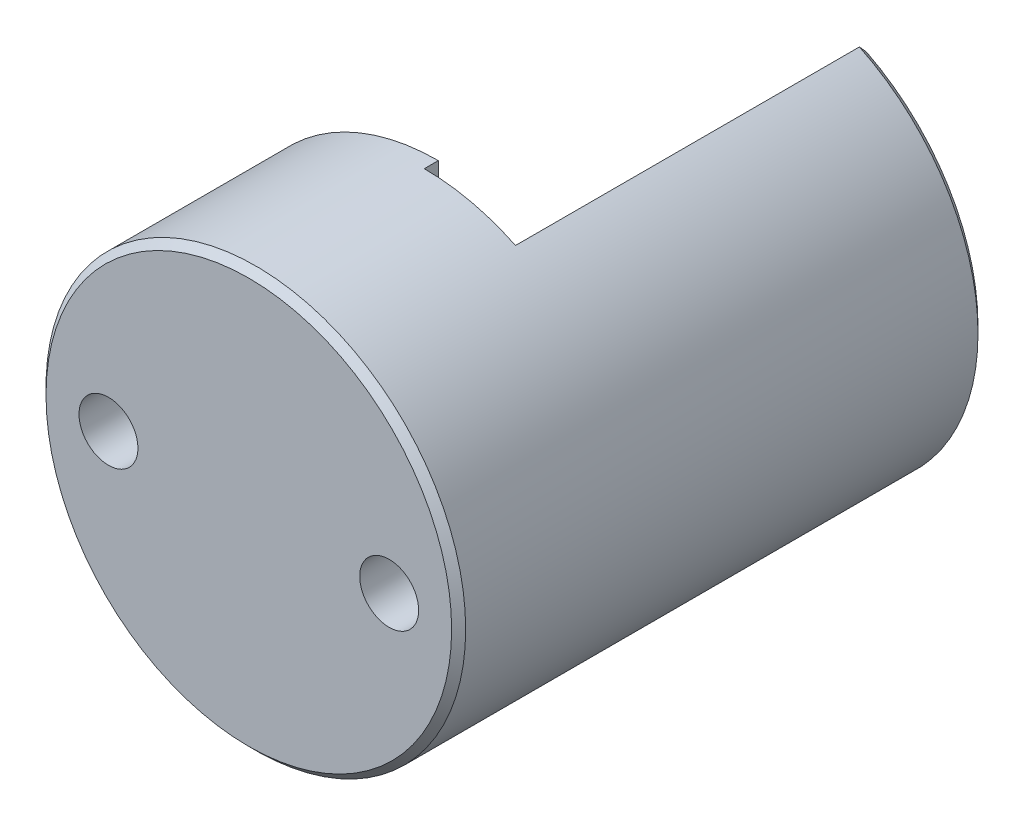
ISO-10303-21;
HEADER;
FILE_DESCRIPTION(('STEP AP214'),'2;1');
FILE_NAME('part.step','',(''),(''),'','','');
FILE_SCHEMA(('AUTOMOTIVE_DESIGN { 1 0 10303 214 1 1 1 1 }'));
ENDSEC;
DATA;
#1=APPLICATION_CONTEXT('core data for automotive mechanical design processes');
#2=APPLICATION_PROTOCOL_DEFINITION('international standard','automotive_design',2000,#1);
#3=PRODUCT_CONTEXT('',#1,'mechanical');
#4=PRODUCT('Part','Part','',(#3));
#5=PRODUCT_RELATED_PRODUCT_CATEGORY('part','',(#4));
#6=PRODUCT_DEFINITION_FORMATION('','',#4);
#7=PRODUCT_DEFINITION_CONTEXT('part definition',#1,'design');
#8=PRODUCT_DEFINITION('design','',#6,#7);
#9=PRODUCT_DEFINITION_SHAPE('','',#8);
#10=(LENGTH_UNIT() NAMED_UNIT(*) SI_UNIT(.MILLI.,.METRE.));
#11=(NAMED_UNIT(*) PLANE_ANGLE_UNIT() SI_UNIT($,.RADIAN.));
#12=(NAMED_UNIT(*) SI_UNIT($,.STERADIAN.) SOLID_ANGLE_UNIT());
#13=UNCERTAINTY_MEASURE_WITH_UNIT(LENGTH_MEASURE(1.E-05),#10,'distance_accuracy_value','');
#14=(GEOMETRIC_REPRESENTATION_CONTEXT(3) GLOBAL_UNCERTAINTY_ASSIGNED_CONTEXT((#13)) GLOBAL_UNIT_ASSIGNED_CONTEXT((#10,
#11,#12)) REPRESENTATION_CONTEXT('',''));
#15=CARTESIAN_POINT('',(0.,0.,0.));
#16=DIRECTION('',(0.,0.,1.));
#17=DIRECTION('',(1.,0.,0.));
#18=AXIS2_PLACEMENT_3D('',#15,#16,#17);
#19=CARTESIAN_POINT('',(0.,0.,-12.5));
#20=DIRECTION('',(0.,0.,-1.));
#21=DIRECTION('',(-1.,0.,0.));
#22=AXIS2_PLACEMENT_3D('',#19,#20,#21);
#23=PLANE('',#22);
#24=CARTESIAN_POINT('',(0.,0.,-12.5));
#25=DIRECTION('',(0.,0.,-1.));
#26=DIRECTION('',(-1.,0.,0.));
#27=AXIS2_PLACEMENT_3D('',#24,#25,#26);
#28=CIRCLE('',#27,14.9495727735252);
#29=CARTESIAN_POINT('',(6.66499415117538E-10,14.9495727735252,-12.5));
#30=VERTEX_POINT('',#29);
#31=CARTESIAN_POINT('',(6.49981606336589,13.4626192567916,-12.5));
#32=VERTEX_POINT('',#31);
#33=EDGE_CURVE('E98',#30,#32,#28,.T.);
#34=ORIENTED_EDGE('',*,*,#33,.T.);
#35=DIRECTION('',(0.,1.,0.));
#36=VECTOR('',#35,1.);
#37=CARTESIAN_POINT('',(6.49981606336589,13.4626192567916,-12.5));
#38=LINE('',#37,#36);
#39=CARTESIAN_POINT('',(6.49981606336589,-13.4626192567917,-12.5));
#40=VERTEX_POINT('',#39);
#41=EDGE_CURVE('E105',#40,#32,#38,.T.);
#42=ORIENTED_EDGE('',*,*,#41,.F.);
#43=CARTESIAN_POINT('',(6.66499415117538E-10,-14.9495727735252,-12.5));
#44=VERTEX_POINT('',#43);
#45=EDGE_CURVE('E114',#40,#44,#28,.T.);
#46=ORIENTED_EDGE('',*,*,#45,.T.);
#47=DIRECTION('',(0.,-1.,0.));
#48=VECTOR('',#47,1.);
#49=CARTESIAN_POINT('',(6.66499415117538E-10,14.9495727735252,-12.5));
#50=LINE('',#49,#48);
#51=EDGE_CURVE('E112',#30,#44,#50,.T.);
#52=ORIENTED_EDGE('',*,*,#51,.F.);
#53=EDGE_LOOP('',(#34,#42,#46,#52));
#54=FACE_BOUND('',#53,.T.);
#55=ADVANCED_FACE('F47',(#54),#23,.T.);
#56=CARTESIAN_POINT('',(0.,0.,-7.5));
#57=DIRECTION('',(0.,0.,1.));
#58=DIRECTION('',(1.,0.,0.));
#59=AXIS2_PLACEMENT_3D('',#56,#57,#58);
#60=CYLINDRICAL_SURFACE('',#59,14.9495727735252);
#61=CARTESIAN_POINT('',(0.,0.,-0.499999999999999));
#62=DIRECTION('',(0.,0.,1.));
#63=DIRECTION('',(1.,0.,0.));
#64=AXIS2_PLACEMENT_3D('',#61,#62,#63);
#65=CIRCLE('',#64,14.9495727735252);
#66=CARTESIAN_POINT('',(14.9495727735252,0.,-0.499999999999999));
#67=VERTEX_POINT('',#66);
#68=EDGE_CURVE('E11',#67,#67,#65,.F.);
#69=ORIENTED_EDGE('',*,*,#68,.T.);
#70=EDGE_LOOP('',(#69));
#71=FACE_BOUND('',#70,.T.);
#72=DIRECTION('',(0.,0.,1.));
#73=VECTOR('',#72,1.);
#74=CARTESIAN_POINT('',(6.49981606336589,-13.4626192567917,-37.5));
#75=LINE('',#74,#73);
#76=CARTESIAN_POINT('',(6.49981606336589,-13.4626192567917,-37.));
#77=VERTEX_POINT('',#76);
#78=EDGE_CURVE('E101',#77,#40,#75,.T.);
#79=ORIENTED_EDGE('',*,*,#78,.F.);
#80=CARTESIAN_POINT('',(0.,0.,-37.));
#81=DIRECTION('',(0.,0.,-1.));
#82=DIRECTION('',(-1.,0.,0.));
#83=AXIS2_PLACEMENT_3D('',#80,#81,#82);
#84=CIRCLE('',#83,14.9495727735252);
#85=CARTESIAN_POINT('',(6.49981606336589,13.4626192567916,-37.));
#86=VERTEX_POINT('',#85);
#87=EDGE_CURVE('E70',#77,#86,#84,.F.);
#88=ORIENTED_EDGE('',*,*,#87,.T.);
#89=DIRECTION('',(0.,0.,1.));
#90=VECTOR('',#89,1.);
#91=CARTESIAN_POINT('',(6.49981606336589,13.4626192567916,-37.5));
#92=LINE('',#91,#90);
#93=EDGE_CURVE('E93',#86,#32,#92,.T.);
#94=ORIENTED_EDGE('',*,*,#93,.T.);
#95=ORIENTED_EDGE('',*,*,#33,.F.);
#96=DIRECTION('',(0.,0.,1.));
#97=VECTOR('',#96,1.);
#98=CARTESIAN_POINT('',(6.66499415117538E-10,14.9495727735252,-13.5));
#99=LINE('',#98,#97);
#100=CARTESIAN_POINT('',(6.66499415117538E-10,14.9495727735252,-13.5));
#101=VERTEX_POINT('',#100);
#102=EDGE_CURVE('E119',#101,#30,#99,.T.);
#103=ORIENTED_EDGE('',*,*,#102,.F.);
#104=CARTESIAN_POINT('',(0.,0.,-13.5));
#105=DIRECTION('',(0.,0.,-1.));
#106=DIRECTION('',(-1.,0.,0.));
#107=AXIS2_PLACEMENT_3D('',#104,#105,#106);
#108=CIRCLE('',#107,14.9495727735252);
#109=CARTESIAN_POINT('',(6.66499415117538E-10,-14.9495727735252,-13.5));
#110=VERTEX_POINT('',#109);
#111=EDGE_CURVE('E222',#110,#101,#108,.T.);
#112=ORIENTED_EDGE('',*,*,#111,.F.);
#113=DIRECTION('',(0.,0.,1.));
#114=VECTOR('',#113,1.);
#115=CARTESIAN_POINT('',(6.66499415117538E-10,-14.9495727735252,-13.5));
#116=LINE('',#115,#114);
#117=EDGE_CURVE('E227',#110,#44,#116,.T.);
#118=ORIENTED_EDGE('',*,*,#117,.T.);
#119=ORIENTED_EDGE('',*,*,#45,.F.);
#120=EDGE_LOOP('',(#79,#88,#94,#95,#103,#112,#118,#119));
#121=FACE_BOUND('',#120,.T.);
#122=ADVANCED_FACE('F95',(#71,#121),#60,.T.);
#123=CARTESIAN_POINT('',(0.,0.,0.));
#124=DIRECTION('',(0.,0.,1.));
#125=DIRECTION('',(1.,0.,0.));
#126=AXIS2_PLACEMENT_3D('',#123,#124,#125);
#127=PLANE('',#126);
#128=CARTESIAN_POINT('',(0.,0.,0.));
#129=DIRECTION('',(0.,0.,1.));
#130=DIRECTION('',(1.,0.,0.));
#131=AXIS2_PLACEMENT_3D('',#128,#129,#130);
#132=CIRCLE('',#131,14.4495727735252);
#133=CARTESIAN_POINT('',(14.4495727735252,0.,0.));
#134=VERTEX_POINT('',#133);
#135=EDGE_CURVE('E56',#134,#134,#132,.T.);
#136=ORIENTED_EDGE('',*,*,#135,.T.);
#137=EDGE_LOOP('',(#136));
#138=FACE_BOUND('',#137,.T.);
#139=CARTESIAN_POINT('',(-9.99999977648258,9.6393704650255E-10,0.));
#140=DIRECTION('',(0.,0.,1.));
#141=DIRECTION('',(1.,0.,0.));
#142=AXIS2_PLACEMENT_3D('',#139,#140,#141);
#143=CIRCLE('',#142,2.09990390331337);
#144=CARTESIAN_POINT('',(-7.90009587316921,9.6393704650255E-10,0.));
#145=VERTEX_POINT('',#144);
#146=EDGE_CURVE('E113',#145,#145,#143,.T.);
#147=ORIENTED_EDGE('',*,*,#146,.F.);
#148=EDGE_LOOP('',(#147));
#149=FACE_BOUND('',#148,.T.);
#150=CARTESIAN_POINT('',(9.99999977648258,-9.62342185106824E-10,0.));
#151=DIRECTION('',(0.,0.,1.));
#152=DIRECTION('',(1.,0.,0.));
#153=AXIS2_PLACEMENT_3D('',#150,#151,#152);
#154=CIRCLE('',#153,2.09990390331337);
#155=CARTESIAN_POINT('',(12.099903679796,-9.62342185106824E-10,0.));
#156=VERTEX_POINT('',#155);
#157=EDGE_CURVE('E124',#156,#156,#154,.T.);
#158=ORIENTED_EDGE('',*,*,#157,.F.);
#159=EDGE_LOOP('',(#158));
#160=FACE_BOUND('',#159,.T.);
#161=ADVANCED_FACE('F179',(#138,#149,#160),#127,.T.);
#162=CARTESIAN_POINT('',(9.99999977648258,-9.62342185106824E-10,-7.5));
#163=DIRECTION('',(0.,0.,1.));
#164=DIRECTION('',(1.,0.,0.));
#165=AXIS2_PLACEMENT_3D('',#162,#163,#164);
#166=CYLINDRICAL_SURFACE('',#165,2.09990390331337);
#167=CARTESIAN_POINT('',(9.99999977648258,-9.62342185106824E-10,-7.5));
#168=DIRECTION('',(0.,0.,1.));
#169=DIRECTION('',(1.,0.,0.));
#170=AXIS2_PLACEMENT_3D('',#167,#168,#169);
#171=CIRCLE('',#170,2.09990390331337);
#172=CARTESIAN_POINT('',(12.099903679796,-9.62342185106824E-10,-7.5));
#173=VERTEX_POINT('',#172);
#174=EDGE_CURVE('E126',#173,#173,#171,.T.);
#175=ORIENTED_EDGE('',*,*,#174,.F.);
#176=EDGE_LOOP('',(#175));
#177=FACE_BOUND('',#176,.T.);
#178=ORIENTED_EDGE('',*,*,#157,.T.);
#179=EDGE_LOOP('',(#178));
#180=FACE_BOUND('',#179,.T.);
#181=ADVANCED_FACE('F175',(#177,#180),#166,.F.);
#182=CARTESIAN_POINT('',(-9.99999977648258,9.6393704650255E-10,-7.5));
#183=DIRECTION('',(0.,0.,1.));
#184=DIRECTION('',(1.,0.,0.));
#185=AXIS2_PLACEMENT_3D('',#182,#183,#184);
#186=CYLINDRICAL_SURFACE('',#185,2.09990390331337);
#187=CARTESIAN_POINT('',(-9.99999977648258,9.6393704650255E-10,-7.5));
#188=DIRECTION('',(0.,0.,1.));
#189=DIRECTION('',(1.,0.,0.));
#190=AXIS2_PLACEMENT_3D('',#187,#188,#189);
#191=CIRCLE('',#190,2.09990390331337);
#192=CARTESIAN_POINT('',(-7.90009587316921,9.6393704650255E-10,-7.5));
#193=VERTEX_POINT('',#192);
#194=EDGE_CURVE('E117',#193,#193,#191,.T.);
#195=ORIENTED_EDGE('',*,*,#194,.F.);
#196=EDGE_LOOP('',(#195));
#197=FACE_BOUND('',#196,.T.);
#198=ORIENTED_EDGE('',*,*,#146,.T.);
#199=EDGE_LOOP('',(#198));
#200=FACE_BOUND('',#199,.T.);
#201=ADVANCED_FACE('F172',(#197,#200),#186,.F.);
#202=CARTESIAN_POINT('',(0.,0.,-7.5));
#203=DIRECTION('',(0.,0.,-1.));
#204=DIRECTION('',(-1.,0.,0.));
#205=AXIS2_PLACEMENT_3D('',#202,#203,#204);
#206=PLANE('',#205);
#207=ORIENTED_EDGE('',*,*,#174,.T.);
#208=EDGE_LOOP('',(#207));
#209=FACE_BOUND('',#208,.T.);
#210=ADVANCED_FACE('F170',(#209),#206,.F.);
#211=ORIENTED_EDGE('',*,*,#194,.T.);
#212=EDGE_LOOP('',(#211));
#213=FACE_BOUND('',#212,.T.);
#214=ADVANCED_FACE('F164',(#213),#206,.F.);
#215=CARTESIAN_POINT('',(6.66499415117538E-10,14.9495727735252,-13.5));
#216=DIRECTION('',(-1.,0.,0.));
#217=DIRECTION('',(0.,0.,1.));
#218=AXIS2_PLACEMENT_3D('',#215,#216,#217);
#219=PLANE('',#218);
#220=ORIENTED_EDGE('',*,*,#51,.T.);
#221=ORIENTED_EDGE('',*,*,#117,.F.);
#222=DIRECTION('',(0.,-1.,0.));
#223=VECTOR('',#222,1.);
#224=CARTESIAN_POINT('',(6.66499415117538E-10,14.9495727735252,-13.5));
#225=LINE('',#224,#223);
#226=EDGE_CURVE('E225',#101,#110,#225,.T.);
#227=ORIENTED_EDGE('',*,*,#226,.F.);
#228=ORIENTED_EDGE('',*,*,#102,.T.);
#229=EDGE_LOOP('',(#220,#221,#227,#228));
#230=FACE_BOUND('',#229,.T.);
#231=ADVANCED_FACE('F160',(#230),#219,.F.);
#232=CARTESIAN_POINT('',(0.,0.,-13.5));
#233=DIRECTION('',(0.,0.,-1.));
#234=DIRECTION('',(-1.,0.,0.));
#235=AXIS2_PLACEMENT_3D('',#232,#233,#234);
#236=PLANE('',#235);
#237=ORIENTED_EDGE('',*,*,#111,.T.);
#238=ORIENTED_EDGE('',*,*,#226,.T.);
#239=EDGE_LOOP('',(#237,#238));
#240=FACE_BOUND('',#239,.T.);
#241=ADVANCED_FACE('F155',(#240),#236,.T.);
#242=CARTESIAN_POINT('',(6.49981606336589,13.4626192567916,-37.5));
#243=DIRECTION('',(1.,0.,0.));
#244=DIRECTION('',(0.,1.,0.));
#245=AXIS2_PLACEMENT_3D('',#242,#243,#244);
#246=PLANE('',#245);
#247=DIRECTION('',(0.,1.,0.));
#248=VECTOR('',#247,1.);
#249=CARTESIAN_POINT('',(6.49981606336589,13.4626192567916,-37.5));
#250=LINE('',#249,#248);
#251=CARTESIAN_POINT('',(6.49981606336589,-12.9051363603726,-37.5));
#252=VERTEX_POINT('',#251);
#253=CARTESIAN_POINT('',(6.49981606336589,12.9051363603726,-37.5));
#254=VERTEX_POINT('',#253);
#255=EDGE_CURVE('E102',#252,#254,#250,.T.);
#256=ORIENTED_EDGE('',*,*,#255,.F.);
#257=CARTESIAN_POINT('',(6.49981606336589,-12.9051363603726,-37.5));
#258=CARTESIAN_POINT('',(6.49981606336589,-12.998221467456,-37.4168576469292));
#259=CARTESIAN_POINT('',(6.49981606336589,-13.0912209298656,-37.333619802977));
#260=CARTESIAN_POINT('',(6.49981606336589,-13.2770485619991,-37.1669531363034));
#261=CARTESIAN_POINT('',(6.49981606336589,-13.3698767317291,-37.0835243135891));
#262=CARTESIAN_POINT('',(6.49981606336589,-13.4626192567916,-37.));
#263=B_SPLINE_CURVE_WITH_KNOTS('',3,(#257,#258,#259,#260,#261,#262),.UNSPECIFIED.,.F.,.F.,(4,2,
4),(0.,0.374428829110022,0.748857644767244),.UNSPECIFIED.);
#264=EDGE_CURVE('E63',#252,#77,#263,.T.);
#265=ORIENTED_EDGE('',*,*,#264,.T.);
#266=ORIENTED_EDGE('',*,*,#78,.T.);
#267=ORIENTED_EDGE('',*,*,#41,.T.);
#268=ORIENTED_EDGE('',*,*,#93,.F.);
#269=CARTESIAN_POINT('',(6.49981606336589,13.4626192567917,-37.));
#270=CARTESIAN_POINT('',(6.49981606336589,13.3698767317291,-37.0835243135891));
#271=CARTESIAN_POINT('',(6.49981606336589,13.2770485619991,-37.1669531363034));
#272=CARTESIAN_POINT('',(6.49981606336589,13.0912209298656,-37.333619802977));
#273=CARTESIAN_POINT('',(6.49981606336589,12.998221467456,-37.4168576469292));
#274=CARTESIAN_POINT('',(6.49981606336589,12.9051363603726,-37.5));
#275=B_SPLINE_CURVE_WITH_KNOTS('',3,(#269,#270,#271,#272,#273,#274),.UNSPECIFIED.,.F.,.F.,(4,2,
4),(0.,0.374428815657224,0.748857644767247),.UNSPECIFIED.);
#276=EDGE_CURVE('E134',#86,#254,#275,.T.);
#277=ORIENTED_EDGE('',*,*,#276,.T.);
#278=EDGE_LOOP('',(#256,#265,#266,#267,#268,#277));
#279=FACE_BOUND('',#278,.T.);
#280=ADVANCED_FACE('F106',(#279),#246,.F.);
#281=CARTESIAN_POINT('',(0.,0.,-37.5));
#282=DIRECTION('',(0.,0.,-1.));
#283=DIRECTION('',(-1.,0.,0.));
#284=AXIS2_PLACEMENT_3D('',#281,#282,#283);
#285=PLANE('',#284);
#286=CARTESIAN_POINT('',(9.99999977648258,-9.66594642867746E-10,-37.5));
#287=DIRECTION('',(0.,0.,-1.));
#288=DIRECTION('',(-1.,0.,0.));
#289=AXIS2_PLACEMENT_3D('',#286,#287,#288);
#290=CIRCLE('',#289,2.09990390319453);
#291=CARTESIAN_POINT('',(7.90009587328806,-9.66594642867746E-10,-37.5));
#292=VERTEX_POINT('',#291);
#293=EDGE_CURVE('E218',#292,#292,#290,.T.);
#294=ORIENTED_EDGE('',*,*,#293,.F.);
#295=EDGE_LOOP('',(#294));
#296=FACE_BOUND('',#295,.T.);
#297=ORIENTED_EDGE('',*,*,#255,.T.);
#298=CARTESIAN_POINT('',(0.,0.,-37.5));
#299=DIRECTION('',(0.,0.,-1.));
#300=DIRECTION('',(-1.,0.,0.));
#301=AXIS2_PLACEMENT_3D('',#298,#299,#300);
#302=CIRCLE('',#301,14.4495727735252);
#303=EDGE_CURVE('E129',#254,#252,#302,.T.);
#304=ORIENTED_EDGE('',*,*,#303,.T.);
#305=EDGE_LOOP('',(#297,#304));
#306=FACE_BOUND('',#305,.T.);
#307=ADVANCED_FACE('F154',(#296,#306),#285,.T.);
#308=CARTESIAN_POINT('',(9.99999977648258,-9.66594642867746E-10,-30.5));
#309=DIRECTION('',(0.,0.,-1.));
#310=DIRECTION('',(-1.,0.,0.));
#311=AXIS2_PLACEMENT_3D('',#308,#309,#310);
#312=CYLINDRICAL_SURFACE('',#311,2.09990390319453);
#313=CARTESIAN_POINT('',(9.99999977648258,-9.66594642867746E-10,-30.5));
#314=DIRECTION('',(0.,0.,-1.));
#315=DIRECTION('',(-1.,0.,0.));
#316=AXIS2_PLACEMENT_3D('',#313,#314,#315);
#317=CIRCLE('',#316,2.09990390319453);
#318=CARTESIAN_POINT('',(7.90009587328806,-9.66594642867746E-10,-30.5));
#319=VERTEX_POINT('',#318);
#320=EDGE_CURVE('E109',#319,#319,#317,.T.);
#321=ORIENTED_EDGE('',*,*,#320,.F.);
#322=EDGE_LOOP('',(#321));
#323=FACE_BOUND('',#322,.T.);
#324=ORIENTED_EDGE('',*,*,#293,.T.);
#325=EDGE_LOOP('',(#324));
#326=FACE_BOUND('',#325,.T.);
#327=ADVANCED_FACE('F210',(#323,#326),#312,.F.);
#328=CARTESIAN_POINT('',(9.99999977648258,-9.66594642867746E-10,-30.5));
#329=DIRECTION('',(0.,0.,-1.));
#330=DIRECTION('',(-1.,0.,0.));
#331=AXIS2_PLACEMENT_3D('',#328,#329,#330);
#332=PLANE('',#331);
#333=ORIENTED_EDGE('',*,*,#320,.T.);
#334=EDGE_LOOP('',(#333));
#335=FACE_BOUND('',#334,.T.);
#336=ADVANCED_FACE('F203',(#335),#332,.T.);
#337=CARTESIAN_POINT('',(0.,0.,-37.5));
#338=DIRECTION('',(0.,0.,1.));
#339=DIRECTION('',(1.,0.,0.));
#340=AXIS2_PLACEMENT_3D('',#337,#338,#339);
#341=CONICAL_SURFACE('',#340,14.4495727735252,0.785398163397447);
#342=ORIENTED_EDGE('',*,*,#276,.F.);
#343=ORIENTED_EDGE('',*,*,#87,.F.);
#344=ORIENTED_EDGE('',*,*,#264,.F.);
#345=ORIENTED_EDGE('',*,*,#303,.F.);
#346=EDGE_LOOP('',(#342,#343,#344,#345));
#347=FACE_BOUND('',#346,.T.);
#348=ADVANCED_FACE('F147',(#347),#341,.T.);
#349=CARTESIAN_POINT('',(0.,0.,0.));
#350=DIRECTION('',(0.,0.,-1.));
#351=DIRECTION('',(-1.,0.,0.));
#352=AXIS2_PLACEMENT_3D('',#349,#350,#351);
#353=CONICAL_SURFACE('',#352,14.4495727735252,0.785398163397443);
#354=ORIENTED_EDGE('',*,*,#68,.F.);
#355=EDGE_LOOP('',(#354));
#356=FACE_BOUND('',#355,.T.);
#357=ORIENTED_EDGE('',*,*,#135,.F.);
#358=EDGE_LOOP('',(#357));
#359=FACE_BOUND('',#358,.T.);
#360=ADVANCED_FACE('F50',(#356,#359),#353,.T.);
#361=CLOSED_SHELL('',(#55,#122,#161,#181,#201,#210,#214,#231,#241,#280,#307,#327,#336,#348,#360));
#362=MANIFOLD_SOLID_BREP('B2',#361);
#363=ADVANCED_BREP_SHAPE_REPRESENTATION('',(#18,#362),#14);
#364=SHAPE_DEFINITION_REPRESENTATION(#9,#363);
ENDSEC;
END-ISO-10303-21;
